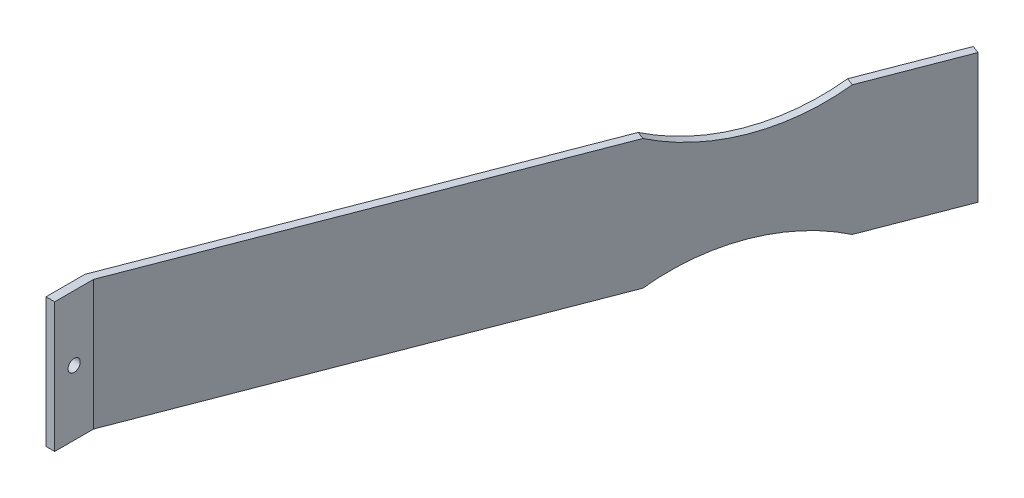
ISO-10303-21;
HEADER;
FILE_DESCRIPTION(('STEP AP214'),'2;1');
FILE_NAME('part.step','',(''),(''),'','','');
FILE_SCHEMA(('AUTOMOTIVE_DESIGN { 1 0 10303 214 1 1 1 1 }'));
ENDSEC;
DATA;
#1=APPLICATION_CONTEXT('core data for automotive mechanical design processes');
#2=APPLICATION_PROTOCOL_DEFINITION('international standard','automotive_design',2000,#1);
#3=PRODUCT_CONTEXT('',#1,'mechanical');
#4=PRODUCT('Part','Part','',(#3));
#5=PRODUCT_RELATED_PRODUCT_CATEGORY('part','',(#4));
#6=PRODUCT_DEFINITION_FORMATION('','',#4);
#7=PRODUCT_DEFINITION_CONTEXT('part definition',#1,'design');
#8=PRODUCT_DEFINITION('design','',#6,#7);
#9=PRODUCT_DEFINITION_SHAPE('','',#8);
#10=(LENGTH_UNIT() NAMED_UNIT(*) SI_UNIT(.MILLI.,.METRE.));
#11=(NAMED_UNIT(*) PLANE_ANGLE_UNIT() SI_UNIT($,.RADIAN.));
#12=(NAMED_UNIT(*) SI_UNIT($,.STERADIAN.) SOLID_ANGLE_UNIT());
#13=UNCERTAINTY_MEASURE_WITH_UNIT(LENGTH_MEASURE(1.E-05),#10,'distance_accuracy_value','');
#14=(GEOMETRIC_REPRESENTATION_CONTEXT(3) GLOBAL_UNCERTAINTY_ASSIGNED_CONTEXT((#13)) GLOBAL_UNIT_ASSIGNED_CONTEXT((#10,
#11,#12)) REPRESENTATION_CONTEXT('',''));
#15=CARTESIAN_POINT('',(0.,0.,0.));
#16=DIRECTION('',(0.,0.,1.));
#17=DIRECTION('',(1.,0.,0.));
#18=AXIS2_PLACEMENT_3D('',#15,#16,#17);
#19=CARTESIAN_POINT('',(0.,50.8,0.));
#20=DIRECTION('',(0.,1.,0.));
#21=DIRECTION('',(0.,0.,1.));
#22=AXIS2_PLACEMENT_3D('',#19,#20,#21);
#23=PLANE('',#22);
#24=DIRECTION('',(0.933263049970683,0.,0.359193651891871));
#25=VECTOR('',#24,1.);
#26=CARTESIAN_POINT('',(-303.413718912177,50.8,-71.4625873122095));
#27=LINE('',#26,#25);
#28=CARTESIAN_POINT('',(-219.162185215871,50.8,-39.0359139677352));
#29=VERTEX_POINT('',#28);
#30=CARTESIAN_POINT('',(-216.199075032214,50.8,-37.8954741229786));
#31=VERTEX_POINT('',#30);
#32=EDGE_CURVE('E11',#29,#31,#27,.T.);
#33=ORIENTED_EDGE('',*,*,#32,.F.);
#34=DIRECTION('',(-0.359193651891871,0.,0.933263049970683));
#35=VECTOR('',#34,1.);
#36=CARTESIAN_POINT('',(-279.4,50.8,117.475));
#37=LINE('',#36,#35);
#38=CARTESIAN_POINT('',(-279.4,50.8,117.475));
#39=VERTEX_POINT('',#38);
#40=EDGE_CURVE('E188',#29,#39,#37,.T.);
#41=ORIENTED_EDGE('',*,*,#40,.T.);
#42=DIRECTION('',(0.,0.,1.));
#43=VECTOR('',#42,1.);
#44=CARTESIAN_POINT('',(-279.4,50.8,117.475));
#45=LINE('',#44,#43);
#46=CARTESIAN_POINT('',(-279.4,50.8,132.715));
#47=VERTEX_POINT('',#46);
#48=EDGE_CURVE('E193',#39,#47,#45,.T.);
#49=ORIENTED_EDGE('',*,*,#48,.T.);
#50=DIRECTION('',(1.,0.,0.));
#51=VECTOR('',#50,1.);
#52=CARTESIAN_POINT('',(-279.4,50.8,132.715));
#53=LINE('',#52,#51);
#54=CARTESIAN_POINT('',(-275.997958099702,50.8,132.715));
#55=VERTEX_POINT('',#54);
#56=EDGE_CURVE('E195',#47,#55,#53,.T.);
#57=ORIENTED_EDGE('',*,*,#56,.T.);
#58=DIRECTION('',(0.,0.,-1.));
#59=VECTOR('',#58,1.);
#60=CARTESIAN_POINT('',(-275.997958099702,50.8,117.475));
#61=LINE('',#60,#59);
#62=CARTESIAN_POINT('',(-275.997958099702,50.8,117.475));
#63=VERTEX_POINT('',#62);
#64=EDGE_CURVE('E132',#55,#63,#61,.T.);
#65=ORIENTED_EDGE('',*,*,#64,.T.);
#66=DIRECTION('',(0.359193651891871,0.,-0.933263049970683));
#67=VECTOR('',#66,1.);
#68=CARTESIAN_POINT('',(-275.997958099702,50.8,117.475));
#69=LINE('',#68,#67);
#70=EDGE_CURVE('E126',#63,#31,#69,.T.);
#71=ORIENTED_EDGE('',*,*,#70,.T.);
#72=EDGE_LOOP('',(#33,#41,#49,#57,#65,#71));
#73=FACE_BOUND('',#72,.T.);
#74=ADVANCED_FACE('F41',(#73),#23,.T.);
#75=CARTESIAN_POINT('',(0.,0.,0.));
#76=DIRECTION('',(0.,1.,0.));
#77=DIRECTION('',(0.,0.,1.));
#78=AXIS2_PLACEMENT_3D('',#75,#76,#77);
#79=PLANE('',#78);
#80=DIRECTION('',(-0.359193651891871,0.,0.933263049970683));
#81=VECTOR('',#80,1.);
#82=CARTESIAN_POINT('',(-279.4,0.,117.475));
#83=LINE('',#82,#81);
#84=CARTESIAN_POINT('',(-219.162185215871,0.,-39.0359139677352));
#85=VERTEX_POINT('',#84);
#86=CARTESIAN_POINT('',(-279.4,0.,117.475));
#87=VERTEX_POINT('',#86);
#88=EDGE_CURVE('E145',#85,#87,#83,.T.);
#89=ORIENTED_EDGE('',*,*,#88,.F.);
#90=DIRECTION('',(0.933263049970683,0.,0.359193651891871));
#91=VECTOR('',#90,1.);
#92=CARTESIAN_POINT('',(-303.413718912177,0.,-71.4625873122094));
#93=LINE('',#92,#91);
#94=CARTESIAN_POINT('',(-216.199075032214,0.,-37.8954741229786));
#95=VERTEX_POINT('',#94);
#96=EDGE_CURVE('E179',#85,#95,#93,.T.);
#97=ORIENTED_EDGE('',*,*,#96,.T.);
#98=DIRECTION('',(0.359193651891871,0.,-0.933263049970683));
#99=VECTOR('',#98,1.);
#100=CARTESIAN_POINT('',(-275.997958099702,0.,117.475));
#101=LINE('',#100,#99);
#102=CARTESIAN_POINT('',(-275.997958099702,0.,117.475));
#103=VERTEX_POINT('',#102);
#104=EDGE_CURVE('E157',#103,#95,#101,.T.);
#105=ORIENTED_EDGE('',*,*,#104,.F.);
#106=DIRECTION('',(0.,0.,-1.));
#107=VECTOR('',#106,1.);
#108=CARTESIAN_POINT('',(-275.997958099702,0.,117.475));
#109=LINE('',#108,#107);
#110=CARTESIAN_POINT('',(-275.997958099702,0.,132.715));
#111=VERTEX_POINT('',#110);
#112=EDGE_CURVE('E154',#111,#103,#109,.T.);
#113=ORIENTED_EDGE('',*,*,#112,.F.);
#114=DIRECTION('',(1.,0.,0.));
#115=VECTOR('',#114,1.);
#116=CARTESIAN_POINT('',(-279.4,0.,132.715));
#117=LINE('',#116,#115);
#118=CARTESIAN_POINT('',(-279.4,0.,132.715));
#119=VERTEX_POINT('',#118);
#120=EDGE_CURVE('E152',#119,#111,#117,.T.);
#121=ORIENTED_EDGE('',*,*,#120,.F.);
#122=DIRECTION('',(0.,0.,1.));
#123=VECTOR('',#122,1.);
#124=CARTESIAN_POINT('',(-279.4,0.,117.475));
#125=LINE('',#124,#123);
#126=EDGE_CURVE('E150',#87,#119,#125,.T.);
#127=ORIENTED_EDGE('',*,*,#126,.F.);
#128=EDGE_LOOP('',(#89,#97,#105,#113,#121,#127));
#129=FACE_BOUND('',#128,.T.);
#130=ADVANCED_FACE('F213',(#129),#79,.F.);
#131=CARTESIAN_POINT('',(-182.668110183657,50.8,-133.855439844757));
#132=DIRECTION('',(-0.359193651891903,0.,0.93326304997067));
#133=DIRECTION('',(0.933263049970671,0.,0.359193651891903));
#134=AXIS2_PLACEMENT_3D('',#131,#132,#133);
#135=PLANE('',#134);
#136=DIRECTION('',(-0.933263049970671,0.,-0.359193651891903));
#137=VECTOR('',#136,1.);
#138=CARTESIAN_POINT('',(-182.668110183657,0.,-133.855439844757));
#139=LINE('',#138,#137);
#140=CARTESIAN_POINT('',(-179.705,0.,-132.715));
#141=VERTEX_POINT('',#140);
#142=CARTESIAN_POINT('',(-182.668110183657,0.,-133.855439844757));
#143=VERTEX_POINT('',#142);
#144=EDGE_CURVE('E142',#141,#143,#139,.T.);
#145=ORIENTED_EDGE('',*,*,#144,.T.);
#146=DIRECTION('',(0.,-1.,0.));
#147=VECTOR('',#146,1.);
#148=CARTESIAN_POINT('',(-182.668110183657,50.8,-133.855439844757));
#149=LINE('',#148,#147);
#150=CARTESIAN_POINT('',(-182.668110183657,50.8,-133.855439844757));
#151=VERTEX_POINT('',#150);
#152=EDGE_CURVE('E171',#151,#143,#149,.T.);
#153=ORIENTED_EDGE('',*,*,#152,.F.);
#154=DIRECTION('',(-0.933263049970671,0.,-0.359193651891903));
#155=VECTOR('',#154,1.);
#156=CARTESIAN_POINT('',(-182.668110183657,50.8,-133.855439844757));
#157=LINE('',#156,#155);
#158=CARTESIAN_POINT('',(-179.705,50.8,-132.715));
#159=VERTEX_POINT('',#158);
#160=EDGE_CURVE('E159',#159,#151,#157,.T.);
#161=ORIENTED_EDGE('',*,*,#160,.F.);
#162=DIRECTION('',(0.,-1.,0.));
#163=VECTOR('',#162,1.);
#164=CARTESIAN_POINT('',(-179.705,50.8,-132.715));
#165=LINE('',#164,#163);
#166=EDGE_CURVE('E134',#159,#141,#165,.T.);
#167=ORIENTED_EDGE('',*,*,#166,.T.);
#168=EDGE_LOOP('',(#145,#153,#161,#167));
#169=FACE_BOUND('',#168,.T.);
#170=ADVANCED_FACE('F43',(#169),#135,.F.);
#171=CARTESIAN_POINT('',(-279.4,50.8,117.475));
#172=DIRECTION('',(0.933263049970683,0.,0.359193651891871));
#173=DIRECTION('',(0.359193651891871,0.,-0.933263049970683));
#174=AXIS2_PLACEMENT_3D('',#171,#172,#173);
#175=PLANE('',#174);
#176=ORIENTED_EDGE('',*,*,#40,.F.);
#177=CARTESIAN_POINT('',(-207.757786768304,113.135833333333,-68.6670158043044));
#178=DIRECTION('',(0.933263049970683,0.,0.359193651891871));
#179=DIRECTION('',(0.359193651891871,0.,-0.933263049970683));
#180=AXIS2_PLACEMENT_3D('',#177,#178,#179);
#181=CIRCLE('',#180,69.9558333333333);
#182=CARTESIAN_POINT('',(-196.353388320737,50.8,-98.2981176408736));
#183=VERTEX_POINT('',#182);
#184=EDGE_CURVE('E117',#29,#183,#181,.T.);
#185=ORIENTED_EDGE('',*,*,#184,.T.);
#186=EDGE_CURVE('E185',#151,#183,#37,.T.);
#187=ORIENTED_EDGE('',*,*,#186,.F.);
#188=ORIENTED_EDGE('',*,*,#152,.T.);
#189=CARTESIAN_POINT('',(-196.353388320737,0.,-98.2981176408736));
#190=VERTEX_POINT('',#189);
#191=EDGE_CURVE('E147',#143,#190,#83,.T.);
#192=ORIENTED_EDGE('',*,*,#191,.T.);
#193=CARTESIAN_POINT('',(-207.757786768304,-62.3358333333333,-68.6670158043044));
#194=DIRECTION('',(0.933263049970683,0.,0.359193651891871));
#195=DIRECTION('',(0.359193651891871,0.,-0.933263049970683));
#196=AXIS2_PLACEMENT_3D('',#193,#194,#195);
#197=CIRCLE('',#196,69.9558333333333);
#198=EDGE_CURVE('E63',#190,#85,#197,.T.);
#199=ORIENTED_EDGE('',*,*,#198,.T.);
#200=ORIENTED_EDGE('',*,*,#88,.T.);
#201=DIRECTION('',(0.,-1.,0.));
#202=VECTOR('',#201,1.);
#203=CARTESIAN_POINT('',(-279.4,50.8,117.475));
#204=LINE('',#203,#202);
#205=EDGE_CURVE('E168',#39,#87,#204,.T.);
#206=ORIENTED_EDGE('',*,*,#205,.F.);
#207=EDGE_LOOP('',(#176,#185,#187,#188,#192,#199,#200,#206));
#208=FACE_BOUND('',#207,.T.);
#209=ADVANCED_FACE('F184',(#208),#175,.F.);
#210=CARTESIAN_POINT('',(-279.4,50.8,117.475));
#211=DIRECTION('',(1.,0.,0.));
#212=DIRECTION('',(0.,0.,-1.));
#213=AXIS2_PLACEMENT_3D('',#210,#211,#212);
#214=PLANE('',#213);
#215=CARTESIAN_POINT('',(-279.4,25.4,125.095));
#216=DIRECTION('',(-1.,0.,0.));
#217=DIRECTION('',(0.,0.,1.));
#218=AXIS2_PLACEMENT_3D('',#215,#216,#217);
#219=CIRCLE('',#218,2.38125000000001);
#220=CARTESIAN_POINT('',(-279.4,25.4,127.47625));
#221=VERTEX_POINT('',#220);
#222=EDGE_CURVE('E177',#221,#221,#219,.T.);
#223=ORIENTED_EDGE('',*,*,#222,.F.);
#224=EDGE_LOOP('',(#223));
#225=FACE_BOUND('',#224,.T.);
#226=ORIENTED_EDGE('',*,*,#126,.T.);
#227=DIRECTION('',(0.,-1.,0.));
#228=VECTOR('',#227,1.);
#229=CARTESIAN_POINT('',(-279.4,50.8,132.715));
#230=LINE('',#229,#228);
#231=EDGE_CURVE('E165',#47,#119,#230,.T.);
#232=ORIENTED_EDGE('',*,*,#231,.F.);
#233=ORIENTED_EDGE('',*,*,#48,.F.);
#234=ORIENTED_EDGE('',*,*,#205,.T.);
#235=EDGE_LOOP('',(#226,#232,#233,#234));
#236=FACE_BOUND('',#235,.T.);
#237=ADVANCED_FACE('F224',(#225,#236),#214,.F.);
#238=CARTESIAN_POINT('',(-279.4,50.8,132.715));
#239=DIRECTION('',(0.,0.,-1.));
#240=DIRECTION('',(-1.,0.,0.));
#241=AXIS2_PLACEMENT_3D('',#238,#239,#240);
#242=PLANE('',#241);
#243=ORIENTED_EDGE('',*,*,#120,.T.);
#244=DIRECTION('',(0.,-1.,0.));
#245=VECTOR('',#244,1.);
#246=CARTESIAN_POINT('',(-275.997958099702,50.8,132.715));
#247=LINE('',#246,#245);
#248=EDGE_CURVE('E162',#55,#111,#247,.T.);
#249=ORIENTED_EDGE('',*,*,#248,.F.);
#250=ORIENTED_EDGE('',*,*,#56,.F.);
#251=ORIENTED_EDGE('',*,*,#231,.T.);
#252=EDGE_LOOP('',(#243,#249,#250,#251));
#253=FACE_BOUND('',#252,.T.);
#254=ADVANCED_FACE('F204',(#253),#242,.F.);
#255=CARTESIAN_POINT('',(-275.997958099702,50.8,117.475));
#256=DIRECTION('',(-1.,0.,0.));
#257=DIRECTION('',(0.,0.,1.));
#258=AXIS2_PLACEMENT_3D('',#255,#256,#257);
#259=PLANE('',#258);
#260=CARTESIAN_POINT('',(-275.997958099702,25.4,125.095));
#261=DIRECTION('',(-1.,0.,0.));
#262=DIRECTION('',(0.,0.,1.));
#263=AXIS2_PLACEMENT_3D('',#260,#261,#262);
#264=CIRCLE('',#263,2.38125000000001);
#265=CARTESIAN_POINT('',(-275.997958099702,25.4,127.47625));
#266=VERTEX_POINT('',#265);
#267=EDGE_CURVE('E146',#266,#266,#264,.T.);
#268=ORIENTED_EDGE('',*,*,#267,.T.);
#269=EDGE_LOOP('',(#268));
#270=FACE_BOUND('',#269,.T.);
#271=ORIENTED_EDGE('',*,*,#112,.T.);
#272=DIRECTION('',(0.,-1.,0.));
#273=VECTOR('',#272,1.);
#274=CARTESIAN_POINT('',(-275.997958099702,50.8,117.475));
#275=LINE('',#274,#273);
#276=EDGE_CURVE('E137',#63,#103,#275,.T.);
#277=ORIENTED_EDGE('',*,*,#276,.F.);
#278=ORIENTED_EDGE('',*,*,#64,.F.);
#279=ORIENTED_EDGE('',*,*,#248,.T.);
#280=EDGE_LOOP('',(#271,#277,#278,#279));
#281=FACE_BOUND('',#280,.T.);
#282=ADVANCED_FACE('F208',(#270,#281),#259,.F.);
#283=CARTESIAN_POINT('',(-275.997958099702,50.8,117.475));
#284=DIRECTION('',(-0.933263049970683,0.,-0.359193651891871));
#285=DIRECTION('',(-0.359193651891871,0.,0.933263049970683));
#286=AXIS2_PLACEMENT_3D('',#283,#284,#285);
#287=PLANE('',#286);
#288=CARTESIAN_POINT('',(-193.39027813708,50.8,-97.1576777961169));
#289=VERTEX_POINT('',#288);
#290=EDGE_CURVE('E128',#289,#159,#69,.T.);
#291=ORIENTED_EDGE('',*,*,#290,.F.);
#292=CARTESIAN_POINT('',(-204.794676584647,113.135833333333,-67.5265759595478));
#293=DIRECTION('',(0.933263049970683,0.,0.359193651891871));
#294=DIRECTION('',(0.359193651891871,0.,-0.933263049970683));
#295=AXIS2_PLACEMENT_3D('',#292,#293,#294);
#296=CIRCLE('',#295,69.9558333333333);
#297=EDGE_CURVE('E55',#31,#289,#296,.T.);
#298=ORIENTED_EDGE('',*,*,#297,.F.);
#299=ORIENTED_EDGE('',*,*,#70,.F.);
#300=ORIENTED_EDGE('',*,*,#276,.T.);
#301=ORIENTED_EDGE('',*,*,#104,.T.);
#302=CARTESIAN_POINT('',(-204.794676584647,-62.3358333333333,-67.5265759595478));
#303=DIRECTION('',(0.933263049970683,0.,0.359193651891871));
#304=DIRECTION('',(-0.359193651891871,0.,0.933263049970683));
#305=AXIS2_PLACEMENT_3D('',#302,#303,#304);
#306=CIRCLE('',#305,69.9558333333333);
#307=CARTESIAN_POINT('',(-193.39027813708,0.,-97.157677796117));
#308=VERTEX_POINT('',#307);
#309=EDGE_CURVE('E129',#308,#95,#306,.T.);
#310=ORIENTED_EDGE('',*,*,#309,.F.);
#311=EDGE_CURVE('E156',#308,#141,#101,.T.);
#312=ORIENTED_EDGE('',*,*,#311,.T.);
#313=ORIENTED_EDGE('',*,*,#166,.F.);
#314=EDGE_LOOP('',(#291,#298,#299,#300,#301,#310,#312,#313));
#315=FACE_BOUND('',#314,.T.);
#316=ADVANCED_FACE('F124',(#315),#287,.F.);
#317=DIRECTION('',(0.933263049970683,0.,0.359193651891871));
#318=VECTOR('',#317,1.);
#319=CARTESIAN_POINT('',(-280.604922017043,50.8,-130.724790985348));
#320=LINE('',#319,#318);
#321=EDGE_CURVE('E49',#289,#183,#320,.F.);
#322=ORIENTED_EDGE('',*,*,#321,.F.);
#323=ORIENTED_EDGE('',*,*,#290,.T.);
#324=ORIENTED_EDGE('',*,*,#160,.T.);
#325=ORIENTED_EDGE('',*,*,#186,.T.);
#326=EDGE_LOOP('',(#322,#323,#324,#325));
#327=FACE_BOUND('',#326,.T.);
#328=ADVANCED_FACE('F190',(#327),#23,.T.);
#329=ORIENTED_EDGE('',*,*,#311,.F.);
#330=DIRECTION('',(0.933263049970683,0.,0.359193651891871));
#331=VECTOR('',#330,1.);
#332=CARTESIAN_POINT('',(-280.604922017043,0.,-130.724790985348));
#333=LINE('',#332,#331);
#334=EDGE_CURVE('E174',#308,#190,#333,.F.);
#335=ORIENTED_EDGE('',*,*,#334,.T.);
#336=ORIENTED_EDGE('',*,*,#191,.F.);
#337=ORIENTED_EDGE('',*,*,#144,.F.);
#338=EDGE_LOOP('',(#329,#335,#336,#337));
#339=FACE_BOUND('',#338,.T.);
#340=ADVANCED_FACE('F239',(#339),#79,.F.);
#341=CARTESIAN_POINT('',(-179.705,25.4,125.095));
#342=DIRECTION('',(-1.,0.,0.));
#343=DIRECTION('',(0.,0.,1.));
#344=AXIS2_PLACEMENT_3D('',#341,#342,#343);
#345=CYLINDRICAL_SURFACE('',#344,2.38125000000001);
#346=ORIENTED_EDGE('',*,*,#222,.T.);
#347=EDGE_LOOP('',(#346));
#348=FACE_BOUND('',#347,.T.);
#349=ORIENTED_EDGE('',*,*,#267,.F.);
#350=EDGE_LOOP('',(#349));
#351=FACE_BOUND('',#350,.T.);
#352=ADVANCED_FACE('F221',(#348,#351),#345,.F.);
#353=CARTESIAN_POINT('',(-292.00932046461,-62.3358333333333,-101.093689148779));
#354=DIRECTION('',(0.933263049970683,0.,0.359193651891871));
#355=DIRECTION('',(0.359193651891871,0.,-0.933263049970683));
#356=AXIS2_PLACEMENT_3D('',#353,#354,#355);
#357=CYLINDRICAL_SURFACE('',#356,69.9558333333333);
#358=ORIENTED_EDGE('',*,*,#334,.F.);
#359=ORIENTED_EDGE('',*,*,#309,.T.);
#360=ORIENTED_EDGE('',*,*,#96,.F.);
#361=ORIENTED_EDGE('',*,*,#198,.F.);
#362=EDGE_LOOP('',(#358,#359,#360,#361));
#363=FACE_BOUND('',#362,.T.);
#364=ADVANCED_FACE('F215',(#363),#357,.F.);
#365=CARTESIAN_POINT('',(-292.00932046461,113.135833333333,-101.093689148779));
#366=DIRECTION('',(0.933263049970683,0.,0.359193651891871));
#367=DIRECTION('',(0.359193651891871,0.,-0.933263049970683));
#368=AXIS2_PLACEMENT_3D('',#365,#366,#367);
#369=CYLINDRICAL_SURFACE('',#368,69.9558333333333);
#370=ORIENTED_EDGE('',*,*,#32,.T.);
#371=ORIENTED_EDGE('',*,*,#297,.T.);
#372=ORIENTED_EDGE('',*,*,#321,.T.);
#373=ORIENTED_EDGE('',*,*,#184,.F.);
#374=EDGE_LOOP('',(#370,#371,#372,#373));
#375=FACE_BOUND('',#374,.T.);
#376=ADVANCED_FACE('F115',(#375),#369,.F.);
#377=CLOSED_SHELL('',(#74,#130,#170,#209,#237,#254,#282,#316,#328,#340,#352,#364,#376));
#378=MANIFOLD_SOLID_BREP('B2',#377);
#379=ADVANCED_BREP_SHAPE_REPRESENTATION('',(#18,#378),#14);
#380=SHAPE_DEFINITION_REPRESENTATION(#9,#379);
ENDSEC;
END-ISO-10303-21;
